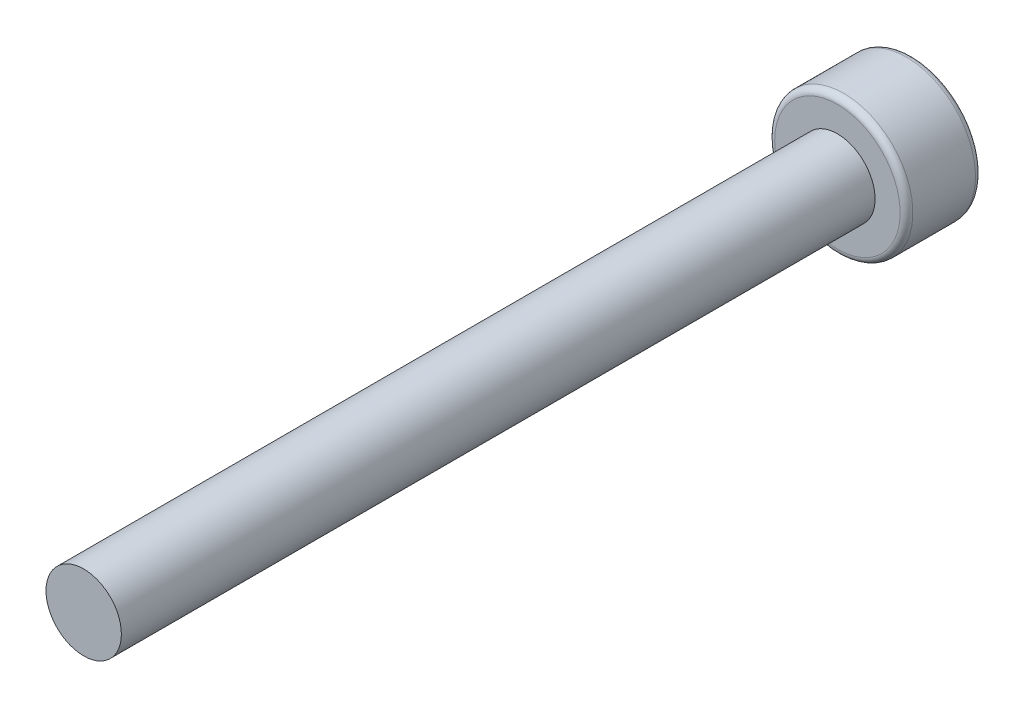
ISO-10303-21;
HEADER;
FILE_DESCRIPTION(('STEP AP214'),'2;1');
FILE_NAME('part.step','',(''),(''),'','','');
FILE_SCHEMA(('AUTOMOTIVE_DESIGN { 1 0 10303 214 1 1 1 1 }'));
ENDSEC;
DATA;
#1=APPLICATION_CONTEXT('core data for automotive mechanical design processes');
#2=APPLICATION_PROTOCOL_DEFINITION('international standard','automotive_design',2000,#1);
#3=PRODUCT_CONTEXT('',#1,'mechanical');
#4=PRODUCT('Part','Part','',(#3));
#5=PRODUCT_RELATED_PRODUCT_CATEGORY('part','',(#4));
#6=PRODUCT_DEFINITION_FORMATION('','',#4);
#7=PRODUCT_DEFINITION_CONTEXT('part definition',#1,'design');
#8=PRODUCT_DEFINITION('design','',#6,#7);
#9=PRODUCT_DEFINITION_SHAPE('','',#8);
#10=(LENGTH_UNIT() NAMED_UNIT(*) SI_UNIT(.MILLI.,.METRE.));
#11=(NAMED_UNIT(*) PLANE_ANGLE_UNIT() SI_UNIT($,.RADIAN.));
#12=(NAMED_UNIT(*) SI_UNIT($,.STERADIAN.) SOLID_ANGLE_UNIT());
#13=UNCERTAINTY_MEASURE_WITH_UNIT(LENGTH_MEASURE(1.E-05),#10,'distance_accuracy_value','');
#14=(GEOMETRIC_REPRESENTATION_CONTEXT(3) GLOBAL_UNCERTAINTY_ASSIGNED_CONTEXT((#13)) GLOBAL_UNIT_ASSIGNED_CONTEXT((#10,
#11,#12)) REPRESENTATION_CONTEXT('',''));
#15=CARTESIAN_POINT('',(0.,0.,0.));
#16=DIRECTION('',(0.,0.,1.));
#17=DIRECTION('',(1.,0.,0.));
#18=AXIS2_PLACEMENT_3D('',#15,#16,#17);
#19=CARTESIAN_POINT('',(0.,0.,30.));
#20=DIRECTION('',(0.,0.,-1.));
#21=DIRECTION('',(-1.,0.,0.));
#22=AXIS2_PLACEMENT_3D('',#19,#20,#21);
#23=CYLINDRICAL_SURFACE('',#22,1.5);
#24=CARTESIAN_POINT('',(0.,0.,30.));
#25=DIRECTION('',(0.,0.,1.));
#26=DIRECTION('',(1.,0.,0.));
#27=AXIS2_PLACEMENT_3D('',#24,#25,#26);
#28=CIRCLE('',#27,1.5);
#29=CARTESIAN_POINT('',(1.5,0.,30.));
#30=VERTEX_POINT('',#29);
#31=EDGE_CURVE('E163',#30,#30,#28,.T.);
#32=ORIENTED_EDGE('',*,*,#31,.F.);
#33=EDGE_LOOP('',(#32));
#34=FACE_BOUND('',#33,.T.);
#35=CARTESIAN_POINT('',(0.,0.,0.));
#36=DIRECTION('',(0.,0.,-1.));
#37=DIRECTION('',(-1.,0.,0.));
#38=AXIS2_PLACEMENT_3D('',#35,#36,#37);
#39=CIRCLE('',#38,1.5);
#40=CARTESIAN_POINT('',(-1.5,0.,0.));
#41=VERTEX_POINT('',#40);
#42=EDGE_CURVE('E150',#41,#41,#39,.T.);
#43=ORIENTED_EDGE('',*,*,#42,.F.);
#44=EDGE_LOOP('',(#43));
#45=FACE_BOUND('',#44,.T.);
#46=ADVANCED_FACE('F34',(#34,#45),#23,.T.);
#47=CARTESIAN_POINT('',(0.,0.,30.));
#48=DIRECTION('',(0.,0.,1.));
#49=DIRECTION('',(1.,0.,0.));
#50=AXIS2_PLACEMENT_3D('',#47,#48,#49);
#51=PLANE('',#50);
#52=ORIENTED_EDGE('',*,*,#31,.T.);
#53=EDGE_LOOP('',(#52));
#54=FACE_BOUND('',#53,.T.);
#55=ADVANCED_FACE('F205',(#54),#51,.T.);
#56=CARTESIAN_POINT('',(0.,0.0184272684771236,0.));
#57=DIRECTION('',(0.,0.,-1.));
#58=DIRECTION('',(-1.,0.,0.));
#59=AXIS2_PLACEMENT_3D('',#56,#57,#58);
#60=PLANE('',#59);
#61=CARTESIAN_POINT('',(0.,0.0184272684771236,0.));
#62=DIRECTION('',(0.,0.,-1.));
#63=DIRECTION('',(-1.,0.,0.));
#64=AXIS2_PLACEMENT_3D('',#61,#62,#63);
#65=CIRCLE('',#64,2.496);
#66=CARTESIAN_POINT('',(-2.496,0.0184272684771236,0.));
#67=VERTEX_POINT('',#66);
#68=EDGE_CURVE('E43',#67,#67,#65,.F.);
#69=ORIENTED_EDGE('',*,*,#68,.T.);
#70=EDGE_LOOP('',(#69));
#71=FACE_BOUND('',#70,.T.);
#72=ORIENTED_EDGE('',*,*,#42,.T.);
#73=EDGE_LOOP('',(#72));
#74=FACE_BOUND('',#73,.T.);
#75=ADVANCED_FACE('F177',(#71,#74),#60,.F.);
#76=CARTESIAN_POINT('',(0.,0.0184272684771236,-3.));
#77=DIRECTION('',(0.,0.,1.));
#78=DIRECTION('',(1.,0.,0.));
#79=AXIS2_PLACEMENT_3D('',#76,#77,#78);
#80=CYLINDRICAL_SURFACE('',#79,2.75);
#81=CARTESIAN_POINT('',(0.,0.0184272684771236,-0.254));
#82=DIRECTION('',(0.,0.,-1.));
#83=DIRECTION('',(-1.,0.,0.));
#84=AXIS2_PLACEMENT_3D('',#81,#82,#83);
#85=CIRCLE('',#84,2.75);
#86=CARTESIAN_POINT('',(-2.75,0.0184272684771236,-0.254));
#87=VERTEX_POINT('',#86);
#88=EDGE_CURVE('E171',#87,#87,#85,.T.);
#89=ORIENTED_EDGE('',*,*,#88,.T.);
#90=EDGE_LOOP('',(#89));
#91=FACE_BOUND('',#90,.T.);
#92=CARTESIAN_POINT('',(0.,0.0184272684771236,-2.746));
#93=DIRECTION('',(0.,0.,-1.));
#94=DIRECTION('',(-1.,0.,0.));
#95=AXIS2_PLACEMENT_3D('',#92,#93,#94);
#96=CIRCLE('',#95,2.75);
#97=CARTESIAN_POINT('',(-2.75,0.0184272684771236,-2.746));
#98=VERTEX_POINT('',#97);
#99=EDGE_CURVE('E167',#98,#98,#96,.F.);
#100=ORIENTED_EDGE('',*,*,#99,.T.);
#101=EDGE_LOOP('',(#100));
#102=FACE_BOUND('',#101,.T.);
#103=ADVANCED_FACE('F186',(#91,#102),#80,.T.);
#104=CARTESIAN_POINT('',(0.,0.0184272684771236,-3.));
#105=DIRECTION('',(0.,0.,-1.));
#106=DIRECTION('',(-1.,0.,0.));
#107=AXIS2_PLACEMENT_3D('',#104,#105,#106);
#108=PLANE('',#107);
#109=DIRECTION('',(-0.628867719488272,0.777512309475304,0.));
#110=VECTOR('',#109,1.);
#111=CARTESIAN_POINT('',(-0.57050483977051,-1.46520567144282,-3.));
#112=LINE('',#111,#110);
#113=CARTESIAN_POINT('',(-0.57050483977051,-1.46520567144282,-3.));
#114=VERTEX_POINT('',#113);
#115=CARTESIAN_POINT('',(-1.57011623574732,-0.229317517259617,-3.));
#116=VERTEX_POINT('',#115);
#117=EDGE_CURVE('E50',#114,#116,#112,.T.);
#118=ORIENTED_EDGE('',*,*,#117,.F.);
#119=DIRECTION('',(-0.987779271504857,-0.155859265959178,0.));
#120=VECTOR('',#119,1.);
#121=CARTESIAN_POINT('',(0.999611395976811,-1.21746088570608,-3.));
#122=LINE('',#121,#120);
#123=CARTESIAN_POINT('',(0.999611395976811,-1.21746088570608,-3.));
#124=VERTEX_POINT('',#123);
#125=EDGE_CURVE('E144',#124,#114,#122,.T.);
#126=ORIENTED_EDGE('',*,*,#125,.F.);
#127=DIRECTION('',(-0.358911552016585,-0.933371575434482,0.));
#128=VECTOR('',#127,1.);
#129=CARTESIAN_POINT('',(1.57011623574732,0.266172054213865,-3.));
#130=LINE('',#129,#128);
#131=CARTESIAN_POINT('',(1.57011623574732,0.266172054213865,-3.));
#132=VERTEX_POINT('',#131);
#133=EDGE_CURVE('E141',#132,#124,#130,.T.);
#134=ORIENTED_EDGE('',*,*,#133,.F.);
#135=DIRECTION('',(0.628867719488272,-0.777512309475304,0.));
#136=VECTOR('',#135,1.);
#137=CARTESIAN_POINT('',(0.57050483977051,1.50206020839707,-3.));
#138=LINE('',#137,#136);
#139=CARTESIAN_POINT('',(0.57050483977051,1.50206020839707,-3.));
#140=VERTEX_POINT('',#139);
#141=EDGE_CURVE('E98',#140,#132,#138,.T.);
#142=ORIENTED_EDGE('',*,*,#141,.F.);
#143=DIRECTION('',(0.987779271504857,0.155859265959178,0.));
#144=VECTOR('',#143,1.);
#145=CARTESIAN_POINT('',(-0.999611395976811,1.25431542266033,-3.));
#146=LINE('',#145,#144);
#147=CARTESIAN_POINT('',(-0.999611395976811,1.25431542266033,-3.));
#148=VERTEX_POINT('',#147);
#149=EDGE_CURVE('E135',#148,#140,#146,.T.);
#150=ORIENTED_EDGE('',*,*,#149,.F.);
#151=DIRECTION('',(0.358911552016585,0.933371575434481,0.));
#152=VECTOR('',#151,1.);
#153=CARTESIAN_POINT('',(-1.57011623574732,-0.229317517259617,-3.));
#154=LINE('',#153,#152);
#155=EDGE_CURVE('E132',#116,#148,#154,.T.);
#156=ORIENTED_EDGE('',*,*,#155,.F.);
#157=EDGE_LOOP('',(#118,#126,#134,#142,#150,#156));
#158=FACE_BOUND('',#157,.T.);
#159=CARTESIAN_POINT('',(0.,0.0184272684771236,-3.));
#160=DIRECTION('',(0.,0.,-1.));
#161=DIRECTION('',(-1.,0.,0.));
#162=AXIS2_PLACEMENT_3D('',#159,#160,#161);
#163=CIRCLE('',#162,2.496);
#164=CARTESIAN_POINT('',(-2.496,0.0184272684771236,-3.));
#165=VERTEX_POINT('',#164);
#166=EDGE_CURVE('E11',#165,#165,#163,.T.);
#167=ORIENTED_EDGE('',*,*,#166,.T.);
#168=EDGE_LOOP('',(#167));
#169=FACE_BOUND('',#168,.T.);
#170=ADVANCED_FACE('F183',(#158,#169),#108,.T.);
#171=CARTESIAN_POINT('',(0.,0.0184272684771236,-0.254));
#172=DIRECTION('',(0.,0.,-1.));
#173=DIRECTION('',(-1.,0.,0.));
#174=AXIS2_PLACEMENT_3D('',#171,#172,#173);
#175=TOROIDAL_SURFACE('',#174,2.496,0.254);
#176=ORIENTED_EDGE('',*,*,#68,.F.);
#177=EDGE_LOOP('',(#176));
#178=FACE_BOUND('',#177,.T.);
#179=ORIENTED_EDGE('',*,*,#88,.F.);
#180=EDGE_LOOP('',(#179));
#181=FACE_BOUND('',#180,.T.);
#182=ADVANCED_FACE('F180',(#178,#181),#175,.T.);
#183=CARTESIAN_POINT('',(0.,0.0184272684771236,-2.746));
#184=DIRECTION('',(0.,0.,-1.));
#185=DIRECTION('',(-1.,0.,0.));
#186=AXIS2_PLACEMENT_3D('',#183,#184,#185);
#187=TOROIDAL_SURFACE('',#186,2.496,0.254);
#188=ORIENTED_EDGE('',*,*,#99,.F.);
#189=EDGE_LOOP('',(#188));
#190=FACE_BOUND('',#189,.T.);
#191=ORIENTED_EDGE('',*,*,#166,.F.);
#192=EDGE_LOOP('',(#191));
#193=FACE_BOUND('',#192,.T.);
#194=ADVANCED_FACE('F36',(#190,#193),#187,.T.);
#195=CARTESIAN_POINT('',(-0.57050483977051,-1.46520567144282,-0.46));
#196=DIRECTION('',(-0.777512309475303,-0.628867719488272,0.));
#197=DIRECTION('',(0.628867719488272,-0.777512309475303,0.));
#198=AXIS2_PLACEMENT_3D('',#195,#196,#197);
#199=PLANE('',#198);
#200=ORIENTED_EDGE('',*,*,#117,.T.);
#201=DIRECTION('',(0.,0.,-1.));
#202=VECTOR('',#201,1.);
#203=CARTESIAN_POINT('',(-1.57011623574732,-0.229317517259617,-0.46));
#204=LINE('',#203,#202);
#205=CARTESIAN_POINT('',(-1.57011623574732,-0.229317517259617,-0.46));
#206=VERTEX_POINT('',#205);
#207=EDGE_CURVE('E80',#206,#116,#204,.T.);
#208=ORIENTED_EDGE('',*,*,#207,.F.);
#209=DIRECTION('',(-0.628867719488272,0.777512309475304,0.));
#210=VECTOR('',#209,1.);
#211=CARTESIAN_POINT('',(-0.57050483977051,-1.46520567144282,-0.46));
#212=LINE('',#211,#210);
#213=CARTESIAN_POINT('',(-0.57050483977051,-1.46520567144282,-0.46));
#214=VERTEX_POINT('',#213);
#215=EDGE_CURVE('E147',#214,#206,#212,.T.);
#216=ORIENTED_EDGE('',*,*,#215,.F.);
#217=DIRECTION('',(0.,0.,-1.));
#218=VECTOR('',#217,1.);
#219=CARTESIAN_POINT('',(-0.57050483977051,-1.46520567144282,-0.46));
#220=LINE('',#219,#218);
#221=EDGE_CURVE('E58',#214,#114,#220,.T.);
#222=ORIENTED_EDGE('',*,*,#221,.T.);
#223=EDGE_LOOP('',(#200,#208,#216,#222));
#224=FACE_BOUND('',#223,.T.);
#225=ADVANCED_FACE('F194',(#224),#199,.F.);
#226=CARTESIAN_POINT('',(0.999611395976811,-1.21746088570608,-0.46));
#227=DIRECTION('',(0.155859265959178,-0.987779271504857,0.));
#228=DIRECTION('',(0.987779271504857,0.155859265959178,0.));
#229=AXIS2_PLACEMENT_3D('',#226,#227,#228);
#230=PLANE('',#229);
#231=ORIENTED_EDGE('',*,*,#125,.T.);
#232=ORIENTED_EDGE('',*,*,#221,.F.);
#233=DIRECTION('',(-0.987779271504857,-0.155859265959178,0.));
#234=VECTOR('',#233,1.);
#235=CARTESIAN_POINT('',(0.999611395976811,-1.21746088570608,-0.46));
#236=LINE('',#235,#234);
#237=CARTESIAN_POINT('',(0.999611395976811,-1.21746088570608,-0.46));
#238=VERTEX_POINT('',#237);
#239=EDGE_CURVE('E112',#238,#214,#236,.T.);
#240=ORIENTED_EDGE('',*,*,#239,.F.);
#241=DIRECTION('',(0.,0.,-1.));
#242=VECTOR('',#241,1.);
#243=CARTESIAN_POINT('',(0.999611395976811,-1.21746088570608,-0.46));
#244=LINE('',#243,#242);
#245=EDGE_CURVE('E103',#238,#124,#244,.T.);
#246=ORIENTED_EDGE('',*,*,#245,.T.);
#247=EDGE_LOOP('',(#231,#232,#240,#246));
#248=FACE_BOUND('',#247,.T.);
#249=ADVANCED_FACE('F249',(#248),#230,.F.);
#250=CARTESIAN_POINT('',(1.57011623574732,0.266172054213865,-0.46));
#251=DIRECTION('',(0.933371575434481,-0.358911552016585,0.));
#252=DIRECTION('',(0.358911552016585,0.933371575434482,0.));
#253=AXIS2_PLACEMENT_3D('',#250,#251,#252);
#254=PLANE('',#253);
#255=ORIENTED_EDGE('',*,*,#133,.T.);
#256=ORIENTED_EDGE('',*,*,#245,.F.);
#257=DIRECTION('',(-0.358911552016585,-0.933371575434482,0.));
#258=VECTOR('',#257,1.);
#259=CARTESIAN_POINT('',(1.57011623574732,0.266172054213865,-0.46));
#260=LINE('',#259,#258);
#261=CARTESIAN_POINT('',(1.57011623574732,0.266172054213865,-0.46));
#262=VERTEX_POINT('',#261);
#263=EDGE_CURVE('E107',#262,#238,#260,.T.);
#264=ORIENTED_EDGE('',*,*,#263,.F.);
#265=DIRECTION('',(0.,0.,-1.));
#266=VECTOR('',#265,1.);
#267=CARTESIAN_POINT('',(1.57011623574732,0.266172054213865,-0.46));
#268=LINE('',#267,#266);
#269=EDGE_CURVE('E91',#262,#132,#268,.T.);
#270=ORIENTED_EDGE('',*,*,#269,.T.);
#271=EDGE_LOOP('',(#255,#256,#264,#270));
#272=FACE_BOUND('',#271,.T.);
#273=ADVANCED_FACE('F108',(#272),#254,.F.);
#274=CARTESIAN_POINT('',(0.57050483977051,1.50206020839707,-0.46));
#275=DIRECTION('',(0.777512309475304,0.628867719488272,0.));
#276=DIRECTION('',(-0.628867719488272,0.777512309475303,0.));
#277=AXIS2_PLACEMENT_3D('',#274,#275,#276);
#278=PLANE('',#277);
#279=ORIENTED_EDGE('',*,*,#141,.T.);
#280=ORIENTED_EDGE('',*,*,#269,.F.);
#281=DIRECTION('',(0.628867719488272,-0.777512309475304,0.));
#282=VECTOR('',#281,1.);
#283=CARTESIAN_POINT('',(0.57050483977051,1.50206020839707,-0.46));
#284=LINE('',#283,#282);
#285=CARTESIAN_POINT('',(0.57050483977051,1.50206020839707,-0.46));
#286=VERTEX_POINT('',#285);
#287=EDGE_CURVE('E95',#286,#262,#284,.T.);
#288=ORIENTED_EDGE('',*,*,#287,.F.);
#289=DIRECTION('',(0.,0.,-1.));
#290=VECTOR('',#289,1.);
#291=CARTESIAN_POINT('',(0.57050483977051,1.50206020839707,-0.46));
#292=LINE('',#291,#290);
#293=EDGE_CURVE('E104',#286,#140,#292,.T.);
#294=ORIENTED_EDGE('',*,*,#293,.T.);
#295=EDGE_LOOP('',(#279,#280,#288,#294));
#296=FACE_BOUND('',#295,.T.);
#297=ADVANCED_FACE('F93',(#296),#278,.F.);
#298=CARTESIAN_POINT('',(-0.999611395976811,1.25431542266033,-0.46));
#299=DIRECTION('',(-0.155859265959178,0.987779271504857,0.));
#300=DIRECTION('',(-0.987779271504857,-0.155859265959178,0.));
#301=AXIS2_PLACEMENT_3D('',#298,#299,#300);
#302=PLANE('',#301);
#303=ORIENTED_EDGE('',*,*,#149,.T.);
#304=ORIENTED_EDGE('',*,*,#293,.F.);
#305=DIRECTION('',(0.987779271504857,0.155859265959178,0.));
#306=VECTOR('',#305,1.);
#307=CARTESIAN_POINT('',(-0.999611395976811,1.25431542266033,-0.46));
#308=LINE('',#307,#306);
#309=CARTESIAN_POINT('',(-0.999611395976811,1.25431542266033,-0.46));
#310=VERTEX_POINT('',#309);
#311=EDGE_CURVE('E118',#310,#286,#308,.T.);
#312=ORIENTED_EDGE('',*,*,#311,.F.);
#313=DIRECTION('',(0.,0.,-1.));
#314=VECTOR('',#313,1.);
#315=CARTESIAN_POINT('',(-0.999611395976811,1.25431542266033,-0.46));
#316=LINE('',#315,#314);
#317=EDGE_CURVE('E155',#310,#148,#316,.T.);
#318=ORIENTED_EDGE('',*,*,#317,.T.);
#319=EDGE_LOOP('',(#303,#304,#312,#318));
#320=FACE_BOUND('',#319,.T.);
#321=ADVANCED_FACE('F273',(#320),#302,.F.);
#322=CARTESIAN_POINT('',(-1.57011623574732,-0.229317517259617,-0.46));
#323=DIRECTION('',(-0.933371575434481,0.358911552016585,0.));
#324=DIRECTION('',(-0.358911552016585,-0.933371575434482,0.));
#325=AXIS2_PLACEMENT_3D('',#322,#323,#324);
#326=PLANE('',#325);
#327=ORIENTED_EDGE('',*,*,#155,.T.);
#328=ORIENTED_EDGE('',*,*,#317,.F.);
#329=DIRECTION('',(0.358911552016585,0.933371575434481,0.));
#330=VECTOR('',#329,1.);
#331=CARTESIAN_POINT('',(-1.57011623574732,-0.229317517259617,-0.46));
#332=LINE('',#331,#330);
#333=EDGE_CURVE('E124',#206,#310,#332,.T.);
#334=ORIENTED_EDGE('',*,*,#333,.F.);
#335=ORIENTED_EDGE('',*,*,#207,.T.);
#336=EDGE_LOOP('',(#327,#328,#334,#335));
#337=FACE_BOUND('',#336,.T.);
#338=ADVANCED_FACE('F282',(#337),#326,.F.);
#339=CARTESIAN_POINT('',(0.,0.,-0.46));
#340=DIRECTION('',(0.,0.,-1.));
#341=DIRECTION('',(-1.,0.,0.));
#342=AXIS2_PLACEMENT_3D('',#339,#340,#341);
#343=PLANE('',#342);
#344=ORIENTED_EDGE('',*,*,#215,.T.);
#345=ORIENTED_EDGE('',*,*,#333,.T.);
#346=ORIENTED_EDGE('',*,*,#311,.T.);
#347=ORIENTED_EDGE('',*,*,#287,.T.);
#348=ORIENTED_EDGE('',*,*,#263,.T.);
#349=ORIENTED_EDGE('',*,*,#239,.T.);
#350=EDGE_LOOP('',(#344,#345,#346,#347,#348,#349));
#351=FACE_BOUND('',#350,.T.);
#352=ADVANCED_FACE('F115',(#351),#343,.T.);
#353=CLOSED_SHELL('',(#46,#55,#75,#103,#170,#182,#194,#225,#249,#273,#297,#321,#338,#352));
#354=MANIFOLD_SOLID_BREP('B2',#353);
#355=ADVANCED_BREP_SHAPE_REPRESENTATION('',(#18,#354),#14);
#356=SHAPE_DEFINITION_REPRESENTATION(#9,#355);
ENDSEC;
END-ISO-10303-21;
